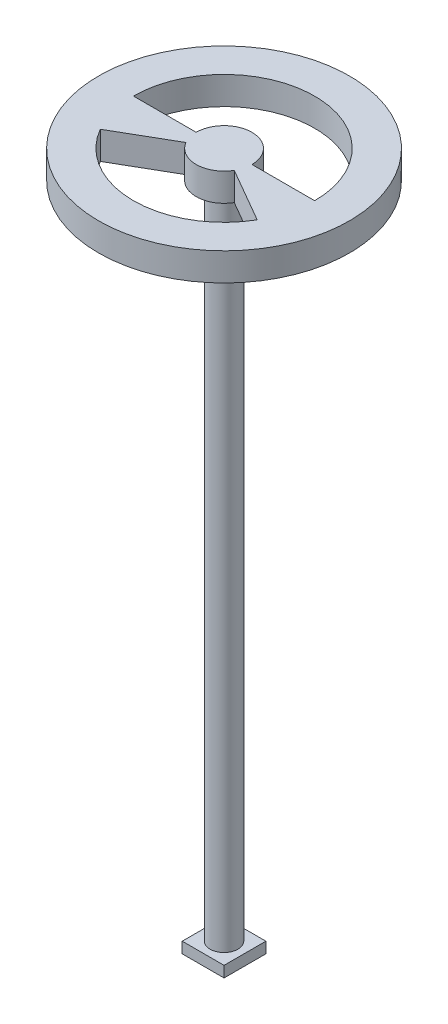
ISO-10303-21;
HEADER;
FILE_DESCRIPTION(('STEP AP214'),'2;1');
FILE_NAME('part.step','',(''),(''),'','','');
FILE_SCHEMA(('AUTOMOTIVE_DESIGN { 1 0 10303 214 1 1 1 1 }'));
ENDSEC;
DATA;
#1=APPLICATION_CONTEXT('core data for automotive mechanical design processes');
#2=APPLICATION_PROTOCOL_DEFINITION('international standard','automotive_design',2000,#1);
#3=PRODUCT_CONTEXT('',#1,'mechanical');
#4=PRODUCT('Part','Part','',(#3));
#5=PRODUCT_RELATED_PRODUCT_CATEGORY('part','',(#4));
#6=PRODUCT_DEFINITION_FORMATION('','',#4);
#7=PRODUCT_DEFINITION_CONTEXT('part definition',#1,'design');
#8=PRODUCT_DEFINITION('design','',#6,#7);
#9=PRODUCT_DEFINITION_SHAPE('','',#8);
#10=(LENGTH_UNIT() NAMED_UNIT(*) SI_UNIT(.MILLI.,.METRE.));
#11=(NAMED_UNIT(*) PLANE_ANGLE_UNIT() SI_UNIT($,.RADIAN.));
#12=(NAMED_UNIT(*) SI_UNIT($,.STERADIAN.) SOLID_ANGLE_UNIT());
#13=UNCERTAINTY_MEASURE_WITH_UNIT(LENGTH_MEASURE(1.E-05),#10,'distance_accuracy_value','');
#14=(GEOMETRIC_REPRESENTATION_CONTEXT(3) GLOBAL_UNCERTAINTY_ASSIGNED_CONTEXT((#13)) GLOBAL_UNIT_ASSIGNED_CONTEXT((#10,
#11,#12)) REPRESENTATION_CONTEXT('',''));
#15=CARTESIAN_POINT('',(0.,0.,0.));
#16=DIRECTION('',(0.,0.,1.));
#17=DIRECTION('',(1.,0.,0.));
#18=AXIS2_PLACEMENT_3D('',#15,#16,#17);
#19=CARTESIAN_POINT('',(0.,635.4,0.));
#20=DIRECTION('',(0.,1.,0.));
#21=DIRECTION('',(0.,0.,1.));
#22=AXIS2_PLACEMENT_3D('',#19,#20,#21);
#23=PLANE('',#22);
#24=DIRECTION('',(-0.866025403784436,0.,0.500000000000004));
#25=VECTOR('',#24,1.);
#26=CARTESIAN_POINT('',(0.,635.4,0.));
#27=LINE('',#26,#25);
#28=CARTESIAN_POINT('',(-21.9970452561247,635.4,12.7000000000001));
#29=VERTEX_POINT('',#28);
#30=CARTESIAN_POINT('',(-71.4903970824052,635.4,41.2750000000003));
#31=VERTEX_POINT('',#30);
#32=EDGE_CURVE('E62',#29,#31,#27,.T.);
#33=ORIENTED_EDGE('',*,*,#32,.F.);
#34=CARTESIAN_POINT('',(0.,635.4,0.));
#35=DIRECTION('',(0.,1.,0.));
#36=DIRECTION('',(0.,0.,1.));
#37=AXIS2_PLACEMENT_3D('',#34,#35,#36);
#38=CIRCLE('',#37,25.4);
#39=CARTESIAN_POINT('',(21.9970452561248,635.4,12.6999999999999));
#40=VERTEX_POINT('',#39);
#41=EDGE_CURVE('E172',#29,#40,#38,.T.);
#42=ORIENTED_EDGE('',*,*,#41,.T.);
#43=DIRECTION('',(0.866025403784441,0.,0.499999999999996));
#44=VECTOR('',#43,1.);
#45=CARTESIAN_POINT('',(0.,635.4,0.));
#46=LINE('',#45,#44);
#47=CARTESIAN_POINT('',(71.4903970824056,635.4,41.2749999999997));
#48=VERTEX_POINT('',#47);
#49=EDGE_CURVE('E185',#40,#48,#46,.T.);
#50=ORIENTED_EDGE('',*,*,#49,.T.);
#51=CARTESIAN_POINT('',(0.,635.4,0.));
#52=DIRECTION('',(0.,1.,0.));
#53=DIRECTION('',(0.,0.,1.));
#54=AXIS2_PLACEMENT_3D('',#51,#52,#53);
#55=CIRCLE('',#54,82.55);
#56=EDGE_CURVE('E182',#31,#48,#55,.T.);
#57=ORIENTED_EDGE('',*,*,#56,.F.);
#58=EDGE_LOOP('',(#33,#42,#50,#57));
#59=FACE_BOUND('',#58,.T.);
#60=CARTESIAN_POINT('',(0.,635.4,0.));
#61=DIRECTION('',(0.,1.,0.));
#62=DIRECTION('',(0.,0.,1.));
#63=AXIS2_PLACEMENT_3D('',#60,#61,#62);
#64=CIRCLE('',#63,114.3);
#65=CARTESIAN_POINT('',(0.,635.4,114.3));
#66=VERTEX_POINT('',#65);
#67=EDGE_CURVE('E196',#66,#66,#64,.T.);
#68=ORIENTED_EDGE('',*,*,#67,.T.);
#69=EDGE_LOOP('',(#68));
#70=FACE_BOUND('',#69,.T.);
#71=CARTESIAN_POINT('',(0.,635.4,0.));
#72=DIRECTION('',(0.,1.,0.));
#73=DIRECTION('',(0.,0.,1.));
#74=AXIS2_PLACEMENT_3D('',#71,#72,#73);
#75=CIRCLE('',#74,82.55);
#76=CARTESIAN_POINT('',(82.55,635.4,-3.83582404175181E-13));
#77=VERTEX_POINT('',#76);
#78=CARTESIAN_POINT('',(-82.55,635.4,3.60822483003176E-13));
#79=VERTEX_POINT('',#78);
#80=EDGE_CURVE('E157',#77,#79,#75,.T.);
#81=ORIENTED_EDGE('',*,*,#80,.F.);
#82=DIRECTION('',(-1.,0.,0.));
#83=VECTOR('',#82,1.);
#84=CARTESIAN_POINT('',(0.,635.4,0.));
#85=LINE('',#84,#83);
#86=CARTESIAN_POINT('',(25.4,635.4,-1.18025355130825E-13));
#87=VERTEX_POINT('',#86);
#88=EDGE_CURVE('E54',#77,#87,#85,.T.);
#89=ORIENTED_EDGE('',*,*,#88,.T.);
#90=CARTESIAN_POINT('',(0.,635.4,0.));
#91=DIRECTION('',(0.,1.,0.));
#92=DIRECTION('',(0.,0.,1.));
#93=AXIS2_PLACEMENT_3D('',#90,#91,#92);
#94=CIRCLE('',#93,25.4);
#95=CARTESIAN_POINT('',(-25.4,635.4,1.11022302462516E-13));
#96=VERTEX_POINT('',#95);
#97=EDGE_CURVE('E148',#87,#96,#94,.T.);
#98=ORIENTED_EDGE('',*,*,#97,.T.);
#99=DIRECTION('',(1.,0.,0.));
#100=VECTOR('',#99,1.);
#101=CARTESIAN_POINT('',(0.,635.4,0.));
#102=LINE('',#101,#100);
#103=EDGE_CURVE('E151',#79,#96,#102,.T.);
#104=ORIENTED_EDGE('',*,*,#103,.F.);
#105=EDGE_LOOP('',(#81,#89,#98,#104));
#106=FACE_BOUND('',#105,.T.);
#107=ADVANCED_FACE('F38',(#59,#70,#106),#23,.T.);
#108=CARTESIAN_POINT('',(0.,610.,0.));
#109=DIRECTION('',(0.,1.,0.));
#110=DIRECTION('',(0.,0.,1.));
#111=AXIS2_PLACEMENT_3D('',#108,#109,#110);
#112=PLANE('',#111);
#113=CARTESIAN_POINT('',(0.,610.,0.));
#114=DIRECTION('',(0.,1.,0.));
#115=DIRECTION('',(0.,0.,1.));
#116=AXIS2_PLACEMENT_3D('',#113,#114,#115);
#117=CIRCLE('',#116,114.3);
#118=CARTESIAN_POINT('',(0.,610.,114.3));
#119=VERTEX_POINT('',#118);
#120=EDGE_CURVE('E164',#119,#119,#117,.T.);
#121=ORIENTED_EDGE('',*,*,#120,.F.);
#122=EDGE_LOOP('',(#121));
#123=FACE_BOUND('',#122,.T.);
#124=CARTESIAN_POINT('',(0.,610.,0.));
#125=DIRECTION('',(0.,1.,0.));
#126=DIRECTION('',(0.,0.,1.));
#127=AXIS2_PLACEMENT_3D('',#124,#125,#126);
#128=CIRCLE('',#127,12.7);
#129=CARTESIAN_POINT('',(0.,610.,12.7));
#130=VERTEX_POINT('',#129);
#131=EDGE_CURVE('E199',#130,#130,#128,.T.);
#132=ORIENTED_EDGE('',*,*,#131,.T.);
#133=EDGE_LOOP('',(#132));
#134=FACE_BOUND('',#133,.T.);
#135=CARTESIAN_POINT('',(0.,610.,0.));
#136=DIRECTION('',(0.,1.,0.));
#137=DIRECTION('',(0.,0.,1.));
#138=AXIS2_PLACEMENT_3D('',#135,#136,#137);
#139=CIRCLE('',#138,25.4);
#140=CARTESIAN_POINT('',(-21.9970452561247,610.,12.7000000000001));
#141=VERTEX_POINT('',#140);
#142=CARTESIAN_POINT('',(21.9970452561248,610.,12.6999999999999));
#143=VERTEX_POINT('',#142);
#144=EDGE_CURVE('E178',#141,#143,#139,.T.);
#145=ORIENTED_EDGE('',*,*,#144,.F.);
#146=DIRECTION('',(-0.866025403784436,0.,0.500000000000004));
#147=VECTOR('',#146,1.);
#148=CARTESIAN_POINT('',(0.,610.,0.));
#149=LINE('',#148,#147);
#150=CARTESIAN_POINT('',(-71.4903970824052,610.,41.2750000000003));
#151=VERTEX_POINT('',#150);
#152=EDGE_CURVE('E168',#141,#151,#149,.T.);
#153=ORIENTED_EDGE('',*,*,#152,.T.);
#154=CARTESIAN_POINT('',(0.,610.,0.));
#155=DIRECTION('',(0.,1.,0.));
#156=DIRECTION('',(0.,0.,1.));
#157=AXIS2_PLACEMENT_3D('',#154,#155,#156);
#158=CIRCLE('',#157,82.55);
#159=CARTESIAN_POINT('',(71.4903970824056,610.,41.2749999999997));
#160=VERTEX_POINT('',#159);
#161=EDGE_CURVE('E171',#151,#160,#158,.T.);
#162=ORIENTED_EDGE('',*,*,#161,.T.);
#163=DIRECTION('',(0.866025403784441,0.,0.499999999999996));
#164=VECTOR('',#163,1.);
#165=CARTESIAN_POINT('',(0.,610.,0.));
#166=LINE('',#165,#164);
#167=EDGE_CURVE('E175',#143,#160,#166,.T.);
#168=ORIENTED_EDGE('',*,*,#167,.F.);
#169=EDGE_LOOP('',(#145,#153,#162,#168));
#170=FACE_BOUND('',#169,.T.);
#171=DIRECTION('',(-1.,0.,0.));
#172=VECTOR('',#171,1.);
#173=CARTESIAN_POINT('',(0.,610.,0.));
#174=LINE('',#173,#172);
#175=CARTESIAN_POINT('',(82.55,610.,-3.83582404175181E-13));
#176=VERTEX_POINT('',#175);
#177=CARTESIAN_POINT('',(25.4,610.,-1.18025355130825E-13));
#178=VERTEX_POINT('',#177);
#179=EDGE_CURVE('E130',#176,#178,#174,.T.);
#180=ORIENTED_EDGE('',*,*,#179,.F.);
#181=CARTESIAN_POINT('',(0.,610.,0.));
#182=DIRECTION('',(0.,1.,0.));
#183=DIRECTION('',(0.,0.,1.));
#184=AXIS2_PLACEMENT_3D('',#181,#182,#183);
#185=CIRCLE('',#184,82.55);
#186=CARTESIAN_POINT('',(-82.55,610.,3.60822483003176E-13));
#187=VERTEX_POINT('',#186);
#188=EDGE_CURVE('E140',#176,#187,#185,.T.);
#189=ORIENTED_EDGE('',*,*,#188,.T.);
#190=DIRECTION('',(1.,0.,0.));
#191=VECTOR('',#190,1.);
#192=CARTESIAN_POINT('',(0.,610.,0.));
#193=LINE('',#192,#191);
#194=CARTESIAN_POINT('',(-25.4,610.,1.11022302462516E-13));
#195=VERTEX_POINT('',#194);
#196=EDGE_CURVE('E144',#187,#195,#193,.T.);
#197=ORIENTED_EDGE('',*,*,#196,.T.);
#198=CARTESIAN_POINT('',(0.,610.,0.));
#199=DIRECTION('',(0.,1.,0.));
#200=DIRECTION('',(0.,0.,1.));
#201=AXIS2_PLACEMENT_3D('',#198,#199,#200);
#202=CIRCLE('',#201,25.4);
#203=EDGE_CURVE('E136',#178,#195,#202,.T.);
#204=ORIENTED_EDGE('',*,*,#203,.F.);
#205=EDGE_LOOP('',(#180,#189,#197,#204));
#206=FACE_BOUND('',#205,.T.);
#207=ADVANCED_FACE('F147',(#123,#134,#170,#206),#112,.F.);
#208=CARTESIAN_POINT('',(19.05,10.,19.05));
#209=DIRECTION('',(-1.,0.,0.));
#210=DIRECTION('',(0.,0.,1.));
#211=AXIS2_PLACEMENT_3D('',#208,#209,#210);
#212=PLANE('',#211);
#213=DIRECTION('',(0.,0.,-1.));
#214=VECTOR('',#213,1.);
#215=CARTESIAN_POINT('',(19.05,0.,19.05));
#216=LINE('',#215,#214);
#217=CARTESIAN_POINT('',(19.05,0.,19.05));
#218=VERTEX_POINT('',#217);
#219=CARTESIAN_POINT('',(19.05,0.,-19.05));
#220=VERTEX_POINT('',#219);
#221=EDGE_CURVE('E203',#218,#220,#216,.T.);
#222=ORIENTED_EDGE('',*,*,#221,.T.);
#223=DIRECTION('',(0.,-1.,0.));
#224=VECTOR('',#223,1.);
#225=CARTESIAN_POINT('',(19.05,10.,-19.05));
#226=LINE('',#225,#224);
#227=CARTESIAN_POINT('',(19.05,10.,-19.05));
#228=VERTEX_POINT('',#227);
#229=EDGE_CURVE('E42',#228,#220,#226,.T.);
#230=ORIENTED_EDGE('',*,*,#229,.F.);
#231=DIRECTION('',(0.,0.,-1.));
#232=VECTOR('',#231,1.);
#233=CARTESIAN_POINT('',(19.05,10.,19.05));
#234=LINE('',#233,#232);
#235=CARTESIAN_POINT('',(19.05,10.,19.05));
#236=VERTEX_POINT('',#235);
#237=EDGE_CURVE('E205',#236,#228,#234,.T.);
#238=ORIENTED_EDGE('',*,*,#237,.F.);
#239=DIRECTION('',(0.,-1.,0.));
#240=VECTOR('',#239,1.);
#241=CARTESIAN_POINT('',(19.05,10.,19.05));
#242=LINE('',#241,#240);
#243=EDGE_CURVE('E215',#236,#218,#242,.T.);
#244=ORIENTED_EDGE('',*,*,#243,.T.);
#245=EDGE_LOOP('',(#222,#230,#238,#244));
#246=FACE_BOUND('',#245,.T.);
#247=ADVANCED_FACE('F40',(#246),#212,.F.);
#248=CARTESIAN_POINT('',(-19.05,10.,-19.05));
#249=DIRECTION('',(0.,0.,1.));
#250=DIRECTION('',(1.,0.,0.));
#251=AXIS2_PLACEMENT_3D('',#248,#249,#250);
#252=PLANE('',#251);
#253=DIRECTION('',(-1.,0.,0.));
#254=VECTOR('',#253,1.);
#255=CARTESIAN_POINT('',(-19.05,0.,-19.05));
#256=LINE('',#255,#254);
#257=CARTESIAN_POINT('',(-19.05,0.,-19.05));
#258=VERTEX_POINT('',#257);
#259=EDGE_CURVE('E218',#220,#258,#256,.T.);
#260=ORIENTED_EDGE('',*,*,#259,.T.);
#261=DIRECTION('',(0.,-1.,0.));
#262=VECTOR('',#261,1.);
#263=CARTESIAN_POINT('',(-19.05,10.,-19.05));
#264=LINE('',#263,#262);
#265=CARTESIAN_POINT('',(-19.05,10.,-19.05));
#266=VERTEX_POINT('',#265);
#267=EDGE_CURVE('E227',#266,#258,#264,.T.);
#268=ORIENTED_EDGE('',*,*,#267,.F.);
#269=DIRECTION('',(-1.,0.,0.));
#270=VECTOR('',#269,1.);
#271=CARTESIAN_POINT('',(-19.05,10.,-19.05));
#272=LINE('',#271,#270);
#273=EDGE_CURVE('E208',#228,#266,#272,.T.);
#274=ORIENTED_EDGE('',*,*,#273,.F.);
#275=ORIENTED_EDGE('',*,*,#229,.T.);
#276=EDGE_LOOP('',(#260,#268,#274,#275));
#277=FACE_BOUND('',#276,.T.);
#278=ADVANCED_FACE('F236',(#277),#252,.F.);
#279=CARTESIAN_POINT('',(-19.05,10.,19.05));
#280=DIRECTION('',(1.,0.,0.));
#281=DIRECTION('',(0.,0.,-1.));
#282=AXIS2_PLACEMENT_3D('',#279,#280,#281);
#283=PLANE('',#282);
#284=DIRECTION('',(0.,0.,1.));
#285=VECTOR('',#284,1.);
#286=CARTESIAN_POINT('',(-19.05,0.,19.05));
#287=LINE('',#286,#285);
#288=CARTESIAN_POINT('',(-19.05,0.,19.05));
#289=VERTEX_POINT('',#288);
#290=EDGE_CURVE('E220',#258,#289,#287,.T.);
#291=ORIENTED_EDGE('',*,*,#290,.T.);
#292=DIRECTION('',(0.,-1.,0.));
#293=VECTOR('',#292,1.);
#294=CARTESIAN_POINT('',(-19.05,10.,19.05));
#295=LINE('',#294,#293);
#296=CARTESIAN_POINT('',(-19.05,10.,19.05));
#297=VERTEX_POINT('',#296);
#298=EDGE_CURVE('E225',#297,#289,#295,.T.);
#299=ORIENTED_EDGE('',*,*,#298,.F.);
#300=DIRECTION('',(0.,0.,1.));
#301=VECTOR('',#300,1.);
#302=CARTESIAN_POINT('',(-19.05,10.,19.05));
#303=LINE('',#302,#301);
#304=EDGE_CURVE('E211',#266,#297,#303,.T.);
#305=ORIENTED_EDGE('',*,*,#304,.F.);
#306=ORIENTED_EDGE('',*,*,#267,.T.);
#307=EDGE_LOOP('',(#291,#299,#305,#306));
#308=FACE_BOUND('',#307,.T.);
#309=ADVANCED_FACE('F245',(#308),#283,.F.);
#310=CARTESIAN_POINT('',(-19.05,10.,19.05));
#311=DIRECTION('',(0.,0.,-1.));
#312=DIRECTION('',(-1.,0.,0.));
#313=AXIS2_PLACEMENT_3D('',#310,#311,#312);
#314=PLANE('',#313);
#315=DIRECTION('',(1.,0.,0.));
#316=VECTOR('',#315,1.);
#317=CARTESIAN_POINT('',(-19.05,0.,19.05));
#318=LINE('',#317,#316);
#319=EDGE_CURVE('E209',#289,#218,#318,.T.);
#320=ORIENTED_EDGE('',*,*,#319,.T.);
#321=ORIENTED_EDGE('',*,*,#243,.F.);
#322=DIRECTION('',(1.,0.,0.));
#323=VECTOR('',#322,1.);
#324=CARTESIAN_POINT('',(-19.05,10.,19.05));
#325=LINE('',#324,#323);
#326=EDGE_CURVE('E213',#297,#236,#325,.T.);
#327=ORIENTED_EDGE('',*,*,#326,.F.);
#328=ORIENTED_EDGE('',*,*,#298,.T.);
#329=EDGE_LOOP('',(#320,#321,#327,#328));
#330=FACE_BOUND('',#329,.T.);
#331=ADVANCED_FACE('F248',(#330),#314,.F.);
#332=CARTESIAN_POINT('',(0.,10.,0.));
#333=DIRECTION('',(0.,-1.,0.));
#334=DIRECTION('',(0.,0.,-1.));
#335=AXIS2_PLACEMENT_3D('',#332,#333,#334);
#336=PLANE('',#335);
#337=CARTESIAN_POINT('',(0.,10.,0.));
#338=DIRECTION('',(0.,1.,0.));
#339=DIRECTION('',(0.,0.,1.));
#340=AXIS2_PLACEMENT_3D('',#337,#338,#339);
#341=CIRCLE('',#340,12.7);
#342=CARTESIAN_POINT('',(0.,10.,12.7));
#343=VERTEX_POINT('',#342);
#344=EDGE_CURVE('E11',#343,#343,#341,.T.);
#345=ORIENTED_EDGE('',*,*,#344,.F.);
#346=EDGE_LOOP('',(#345));
#347=FACE_BOUND('',#346,.T.);
#348=ORIENTED_EDGE('',*,*,#237,.T.);
#349=ORIENTED_EDGE('',*,*,#273,.T.);
#350=ORIENTED_EDGE('',*,*,#304,.T.);
#351=ORIENTED_EDGE('',*,*,#326,.T.);
#352=EDGE_LOOP('',(#348,#349,#350,#351));
#353=FACE_BOUND('',#352,.T.);
#354=ADVANCED_FACE('F250',(#347,#353),#336,.F.);
#355=CARTESIAN_POINT('',(0.,0.,0.));
#356=DIRECTION('',(0.,-1.,0.));
#357=DIRECTION('',(0.,0.,-1.));
#358=AXIS2_PLACEMENT_3D('',#355,#356,#357);
#359=PLANE('',#358);
#360=ORIENTED_EDGE('',*,*,#221,.F.);
#361=ORIENTED_EDGE('',*,*,#319,.F.);
#362=ORIENTED_EDGE('',*,*,#290,.F.);
#363=ORIENTED_EDGE('',*,*,#259,.F.);
#364=EDGE_LOOP('',(#360,#361,#362,#363));
#365=FACE_BOUND('',#364,.T.);
#366=ADVANCED_FACE('F243',(#365),#359,.T.);
#367=CARTESIAN_POINT('',(0.,610.,0.));
#368=DIRECTION('',(0.,-1.,0.));
#369=DIRECTION('',(0.,0.,-1.));
#370=AXIS2_PLACEMENT_3D('',#367,#368,#369);
#371=CYLINDRICAL_SURFACE('',#370,12.7);
#372=ORIENTED_EDGE('',*,*,#131,.F.);
#373=EDGE_LOOP('',(#372));
#374=FACE_BOUND('',#373,.T.);
#375=ORIENTED_EDGE('',*,*,#344,.T.);
#376=EDGE_LOOP('',(#375));
#377=FACE_BOUND('',#376,.T.);
#378=ADVANCED_FACE('F258',(#374,#377),#371,.T.);
#379=CARTESIAN_POINT('',(0.,635.4,0.));
#380=DIRECTION('',(0.,-1.,0.));
#381=DIRECTION('',(0.,0.,-1.));
#382=AXIS2_PLACEMENT_3D('',#379,#380,#381);
#383=CYLINDRICAL_SURFACE('',#382,114.3);
#384=ORIENTED_EDGE('',*,*,#67,.F.);
#385=EDGE_LOOP('',(#384));
#386=FACE_BOUND('',#385,.T.);
#387=ORIENTED_EDGE('',*,*,#120,.T.);
#388=EDGE_LOOP('',(#387));
#389=FACE_BOUND('',#388,.T.);
#390=ADVANCED_FACE('F276',(#386,#389),#383,.T.);
#391=CARTESIAN_POINT('',(0.,610.,0.));
#392=DIRECTION('',(-0.500000000000004,0.,-0.866025403784436));
#393=DIRECTION('',(-0.866025403784436,0.,0.500000000000004));
#394=AXIS2_PLACEMENT_3D('',#391,#392,#393);
#395=PLANE('',#394);
#396=ORIENTED_EDGE('',*,*,#32,.T.);
#397=DIRECTION('',(0.,1.,0.));
#398=VECTOR('',#397,1.);
#399=CARTESIAN_POINT('',(-71.4903970824052,610.,41.2750000000003));
#400=LINE('',#399,#398);
#401=EDGE_CURVE('E180',#151,#31,#400,.T.);
#402=ORIENTED_EDGE('',*,*,#401,.F.);
#403=ORIENTED_EDGE('',*,*,#152,.F.);
#404=DIRECTION('',(0.,1.,0.));
#405=VECTOR('',#404,1.);
#406=CARTESIAN_POINT('',(-21.9970452561247,610.,12.7000000000001));
#407=LINE('',#406,#405);
#408=EDGE_CURVE('E158',#141,#29,#407,.T.);
#409=ORIENTED_EDGE('',*,*,#408,.T.);
#410=EDGE_LOOP('',(#396,#402,#403,#409));
#411=FACE_BOUND('',#410,.T.);
#412=ADVANCED_FACE('F273',(#411),#395,.F.);
#413=CARTESIAN_POINT('',(0.,610.,0.));
#414=DIRECTION('',(0.,1.,0.));
#415=DIRECTION('',(0.,0.,1.));
#416=AXIS2_PLACEMENT_3D('',#413,#414,#415);
#417=CYLINDRICAL_SURFACE('',#416,25.4);
#418=ORIENTED_EDGE('',*,*,#41,.F.);
#419=ORIENTED_EDGE('',*,*,#408,.F.);
#420=ORIENTED_EDGE('',*,*,#144,.T.);
#421=DIRECTION('',(0.,1.,0.));
#422=VECTOR('',#421,1.);
#423=CARTESIAN_POINT('',(21.9970452561248,610.,12.6999999999999));
#424=LINE('',#423,#422);
#425=EDGE_CURVE('E191',#143,#40,#424,.T.);
#426=ORIENTED_EDGE('',*,*,#425,.T.);
#427=EDGE_LOOP('',(#418,#419,#420,#426));
#428=FACE_BOUND('',#427,.T.);
#429=ADVANCED_FACE('F293',(#428),#417,.T.);
#430=CARTESIAN_POINT('',(0.,610.,0.));
#431=DIRECTION('',(-0.499999999999996,0.,0.866025403784441));
#432=DIRECTION('',(0.866025403784441,0.,0.499999999999996));
#433=AXIS2_PLACEMENT_3D('',#430,#431,#432);
#434=PLANE('',#433);
#435=ORIENTED_EDGE('',*,*,#49,.F.);
#436=ORIENTED_EDGE('',*,*,#425,.F.);
#437=ORIENTED_EDGE('',*,*,#167,.T.);
#438=DIRECTION('',(0.,1.,0.));
#439=VECTOR('',#438,1.);
#440=CARTESIAN_POINT('',(71.4903970824056,610.,41.2749999999997));
#441=LINE('',#440,#439);
#442=EDGE_CURVE('E193',#160,#48,#441,.T.);
#443=ORIENTED_EDGE('',*,*,#442,.T.);
#444=EDGE_LOOP('',(#435,#436,#437,#443));
#445=FACE_BOUND('',#444,.T.);
#446=ADVANCED_FACE('F296',(#445),#434,.T.);
#447=CARTESIAN_POINT('',(0.,610.,0.));
#448=DIRECTION('',(0.,1.,0.));
#449=DIRECTION('',(0.,0.,1.));
#450=AXIS2_PLACEMENT_3D('',#447,#448,#449);
#451=CYLINDRICAL_SURFACE('',#450,82.55);
#452=ORIENTED_EDGE('',*,*,#56,.T.);
#453=ORIENTED_EDGE('',*,*,#442,.F.);
#454=ORIENTED_EDGE('',*,*,#161,.F.);
#455=ORIENTED_EDGE('',*,*,#401,.T.);
#456=EDGE_LOOP('',(#452,#453,#454,#455));
#457=FACE_BOUND('',#456,.T.);
#458=ADVANCED_FACE('F299',(#457),#451,.F.);
#459=CARTESIAN_POINT('',(0.,610.,0.));
#460=DIRECTION('',(0.,0.,-1.));
#461=DIRECTION('',(-1.,0.,0.));
#462=AXIS2_PLACEMENT_3D('',#459,#460,#461);
#463=PLANE('',#462);
#464=ORIENTED_EDGE('',*,*,#88,.F.);
#465=DIRECTION('',(0.,1.,0.));
#466=VECTOR('',#465,1.);
#467=CARTESIAN_POINT('',(82.55,610.,-3.83582404175181E-13));
#468=LINE('',#467,#466);
#469=EDGE_CURVE('E126',#176,#77,#468,.T.);
#470=ORIENTED_EDGE('',*,*,#469,.F.);
#471=ORIENTED_EDGE('',*,*,#179,.T.);
#472=DIRECTION('',(0.,1.,0.));
#473=VECTOR('',#472,1.);
#474=CARTESIAN_POINT('',(25.4,610.,-1.18025355130825E-13));
#475=LINE('',#474,#473);
#476=EDGE_CURVE('E162',#178,#87,#475,.T.);
#477=ORIENTED_EDGE('',*,*,#476,.T.);
#478=EDGE_LOOP('',(#464,#470,#471,#477));
#479=FACE_BOUND('',#478,.T.);
#480=ADVANCED_FACE('F128',(#479),#463,.T.);
#481=CARTESIAN_POINT('',(0.,610.,0.));
#482=DIRECTION('',(0.,1.,0.));
#483=DIRECTION('',(0.,0.,1.));
#484=AXIS2_PLACEMENT_3D('',#481,#482,#483);
#485=CYLINDRICAL_SURFACE('',#484,25.4);
#486=ORIENTED_EDGE('',*,*,#97,.F.);
#487=ORIENTED_EDGE('',*,*,#476,.F.);
#488=ORIENTED_EDGE('',*,*,#203,.T.);
#489=DIRECTION('',(0.,1.,0.));
#490=VECTOR('',#489,1.);
#491=CARTESIAN_POINT('',(-25.4,610.,1.11022302462516E-13));
#492=LINE('',#491,#490);
#493=EDGE_CURVE('E165',#195,#96,#492,.T.);
#494=ORIENTED_EDGE('',*,*,#493,.T.);
#495=EDGE_LOOP('',(#486,#487,#488,#494));
#496=FACE_BOUND('',#495,.T.);
#497=ADVANCED_FACE('F316',(#496),#485,.T.);
#498=CARTESIAN_POINT('',(0.,610.,0.));
#499=DIRECTION('',(0.,0.,1.));
#500=DIRECTION('',(1.,0.,0.));
#501=AXIS2_PLACEMENT_3D('',#498,#499,#500);
#502=PLANE('',#501);
#503=ORIENTED_EDGE('',*,*,#103,.T.);
#504=ORIENTED_EDGE('',*,*,#493,.F.);
#505=ORIENTED_EDGE('',*,*,#196,.F.);
#506=DIRECTION('',(0.,1.,0.));
#507=VECTOR('',#506,1.);
#508=CARTESIAN_POINT('',(-82.55,610.,3.60822483003176E-13));
#509=LINE('',#508,#507);
#510=EDGE_CURVE('E135',#187,#79,#509,.T.);
#511=ORIENTED_EDGE('',*,*,#510,.T.);
#512=EDGE_LOOP('',(#503,#504,#505,#511));
#513=FACE_BOUND('',#512,.T.);
#514=ADVANCED_FACE('F320',(#513),#502,.F.);
#515=CARTESIAN_POINT('',(0.,610.,0.));
#516=DIRECTION('',(0.,1.,0.));
#517=DIRECTION('',(0.,0.,1.));
#518=AXIS2_PLACEMENT_3D('',#515,#516,#517);
#519=CYLINDRICAL_SURFACE('',#518,82.55);
#520=ORIENTED_EDGE('',*,*,#80,.T.);
#521=ORIENTED_EDGE('',*,*,#510,.F.);
#522=ORIENTED_EDGE('',*,*,#188,.F.);
#523=ORIENTED_EDGE('',*,*,#469,.T.);
#524=EDGE_LOOP('',(#520,#521,#522,#523));
#525=FACE_BOUND('',#524,.T.);
#526=ADVANCED_FACE('F141',(#525),#519,.F.);
#527=CLOSED_SHELL('',(#107,#207,#247,#278,#309,#331,#354,#366,#378,#390,#412,#429,#446,#458,
#480,#497,#514,#526));
#528=MANIFOLD_SOLID_BREP('B2',#527);
#529=ADVANCED_BREP_SHAPE_REPRESENTATION('',(#18,#528),#14);
#530=SHAPE_DEFINITION_REPRESENTATION(#9,#529);
ENDSEC;
END-ISO-10303-21;
